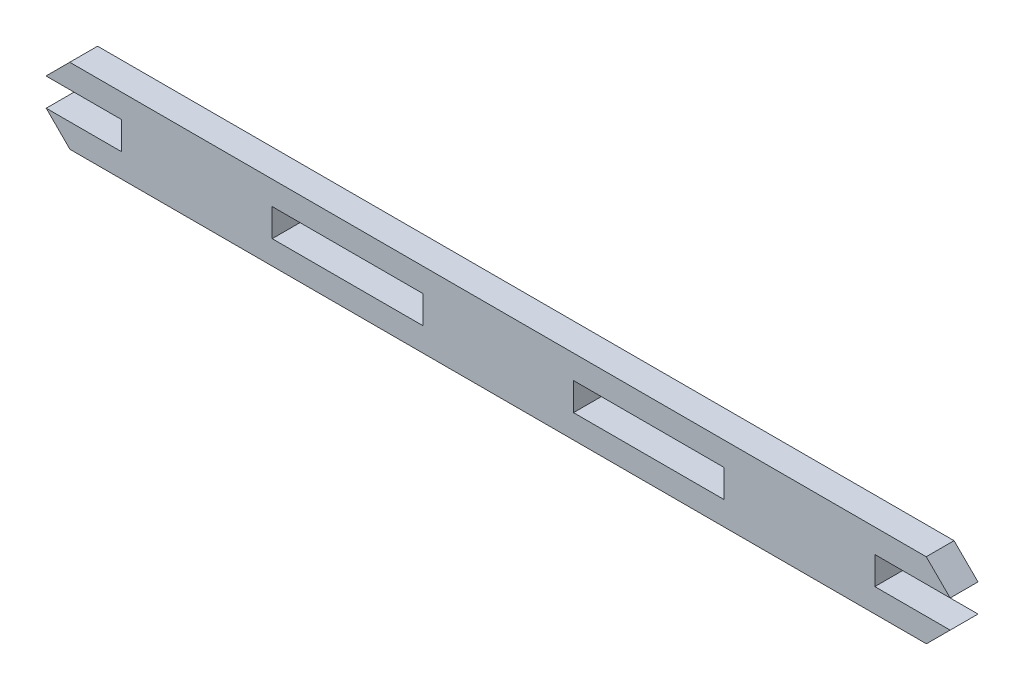
ISO-10303-21;
HEADER;
FILE_DESCRIPTION(('STEP AP214'),'2;1');
FILE_NAME('part.step','',(''),(''),'','','');
FILE_SCHEMA(('AUTOMOTIVE_DESIGN { 1 0 10303 214 1 1 1 1 }'));
ENDSEC;
DATA;
#1=APPLICATION_CONTEXT('core data for automotive mechanical design processes');
#2=APPLICATION_PROTOCOL_DEFINITION('international standard','automotive_design',2000,#1);
#3=PRODUCT_CONTEXT('',#1,'mechanical');
#4=PRODUCT('Part','Part','',(#3));
#5=PRODUCT_RELATED_PRODUCT_CATEGORY('part','',(#4));
#6=PRODUCT_DEFINITION_FORMATION('','',#4);
#7=PRODUCT_DEFINITION_CONTEXT('part definition',#1,'design');
#8=PRODUCT_DEFINITION('design','',#6,#7);
#9=PRODUCT_DEFINITION_SHAPE('','',#8);
#10=(LENGTH_UNIT() NAMED_UNIT(*) SI_UNIT(.MILLI.,.METRE.));
#11=(NAMED_UNIT(*) PLANE_ANGLE_UNIT() SI_UNIT($,.RADIAN.));
#12=(NAMED_UNIT(*) SI_UNIT($,.STERADIAN.) SOLID_ANGLE_UNIT());
#13=UNCERTAINTY_MEASURE_WITH_UNIT(LENGTH_MEASURE(1.E-05),#10,'distance_accuracy_value','');
#14=(GEOMETRIC_REPRESENTATION_CONTEXT(3) GLOBAL_UNCERTAINTY_ASSIGNED_CONTEXT((#13)) GLOBAL_UNIT_ASSIGNED_CONTEXT((#10,
#11,#12)) REPRESENTATION_CONTEXT('',''));
#15=CARTESIAN_POINT('',(0.,0.,0.));
#16=DIRECTION('',(0.,0.,1.));
#17=DIRECTION('',(1.,0.,0.));
#18=AXIS2_PLACEMENT_3D('',#15,#16,#17);
#19=CARTESIAN_POINT('',(0.,0.,5.54));
#20=DIRECTION('',(0.,0.,-1.));
#21=DIRECTION('',(-1.,0.,0.));
#22=AXIS2_PLACEMENT_3D('',#19,#20,#21);
#23=PLANE('',#22);
#24=DIRECTION('',(0.,-1.,0.));
#25=VECTOR('',#24,1.);
#26=CARTESIAN_POINT('',(155.922330422728,10.4160397605776,5.54));
#27=LINE('',#26,#25);
#28=CARTESIAN_POINT('',(155.922330422728,10.4160397605776,5.54));
#29=VERTEX_POINT('',#28);
#30=CARTESIAN_POINT('',(155.922330422728,4.8760397605776,5.54));
#31=VERTEX_POINT('',#30);
#32=EDGE_CURVE('E206',#29,#31,#27,.T.);
#33=ORIENTED_EDGE('',*,*,#32,.F.);
#34=DIRECTION('',(-1.,0.,0.));
#35=VECTOR('',#34,1.);
#36=CARTESIAN_POINT('',(155.922330422728,10.4160397605776,5.54));
#37=LINE('',#36,#35);
#38=CARTESIAN_POINT('',(185.922330422728,10.4160397605776,5.54));
#39=VERTEX_POINT('',#38);
#40=EDGE_CURVE('E214',#39,#29,#37,.T.);
#41=ORIENTED_EDGE('',*,*,#40,.F.);
#42=DIRECTION('',(0.,1.,0.));
#43=VECTOR('',#42,1.);
#44=CARTESIAN_POINT('',(185.922330422728,10.4160397605776,5.54));
#45=LINE('',#44,#43);
#46=CARTESIAN_POINT('',(185.922330422728,4.8760397605776,5.54));
#47=VERTEX_POINT('',#46);
#48=EDGE_CURVE('E211',#47,#39,#45,.T.);
#49=ORIENTED_EDGE('',*,*,#48,.F.);
#50=DIRECTION('',(1.,0.,0.));
#51=VECTOR('',#50,1.);
#52=CARTESIAN_POINT('',(155.922330422728,4.8760397605776,5.54));
#53=LINE('',#52,#51);
#54=EDGE_CURVE('E208',#31,#47,#53,.T.);
#55=ORIENTED_EDGE('',*,*,#54,.F.);
#56=EDGE_LOOP('',(#33,#41,#49,#55));
#57=FACE_BOUND('',#56,.T.);
#58=DIRECTION('',(-0.70710309183126,-0.707110470522586,0.));
#59=VECTOR('',#58,1.);
#60=CARTESIAN_POINT('',(50.8816655425328,10.4159904028131,5.54));
#61=LINE('',#60,#59);
#62=CARTESIAN_POINT('',(55.6116655422753,15.1460397605776,5.54));
#63=VERTEX_POINT('',#62);
#64=CARTESIAN_POINT('',(50.8816655425328,10.4159904028131,5.54));
#65=VERTEX_POINT('',#64);
#66=EDGE_CURVE('E237',#63,#65,#61,.T.);
#67=ORIENTED_EDGE('',*,*,#66,.T.);
#68=DIRECTION('',(1.,0.,0.));
#69=VECTOR('',#68,1.);
#70=CARTESIAN_POINT('',(50.8816655425328,10.4159904028131,5.54));
#71=LINE('',#70,#69);
#72=CARTESIAN_POINT('',(65.9223304227279,10.4159904028131,5.54));
#73=VERTEX_POINT('',#72);
#74=EDGE_CURVE('E240',#65,#73,#71,.T.);
#75=ORIENTED_EDGE('',*,*,#74,.T.);
#76=DIRECTION('',(0.,-1.,0.));
#77=VECTOR('',#76,1.);
#78=CARTESIAN_POINT('',(65.9223304227278,4.8760397605776,5.54));
#79=LINE('',#78,#77);
#80=CARTESIAN_POINT('',(65.9223304227278,4.8760397605776,5.54));
#81=VERTEX_POINT('',#80);
#82=EDGE_CURVE('E243',#73,#81,#79,.T.);
#83=ORIENTED_EDGE('',*,*,#82,.T.);
#84=DIRECTION('',(-1.,0.,0.));
#85=VECTOR('',#84,1.);
#86=CARTESIAN_POINT('',(50.9223304227278,4.8760397605776,5.54));
#87=LINE('',#86,#85);
#88=CARTESIAN_POINT('',(50.9223304227278,4.8760397605776,5.54));
#89=VERTEX_POINT('',#88);
#90=EDGE_CURVE('E245',#81,#89,#87,.T.);
#91=ORIENTED_EDGE('',*,*,#90,.T.);
#92=DIRECTION('',(0.706955946111809,-0.707257584093064,0.));
#93=VECTOR('',#92,1.);
#94=CARTESIAN_POINT('',(50.9223304227278,4.8760397605776,5.54));
#95=LINE('',#94,#93);
#96=CARTESIAN_POINT('',(55.6503131270728,0.146039760577601,5.54));
#97=VERTEX_POINT('',#96);
#98=EDGE_CURVE('E247',#89,#97,#95,.T.);
#99=ORIENTED_EDGE('',*,*,#98,.T.);
#100=DIRECTION('',(1.,0.,0.));
#101=VECTOR('',#100,1.);
#102=CARTESIAN_POINT('',(55.6503131270728,0.146039760577601,5.54));
#103=LINE('',#102,#101);
#104=CARTESIAN_POINT('',(226.190313127073,0.146039760577601,5.54));
#105=VERTEX_POINT('',#104);
#106=EDGE_CURVE('E249',#97,#105,#103,.T.);
#107=ORIENTED_EDGE('',*,*,#106,.T.);
#108=DIRECTION('',(0.707257519797774,0.706956010434526,0.));
#109=VECTOR('',#108,1.);
#110=CARTESIAN_POINT('',(226.190313127073,0.146039760577601,5.54));
#111=LINE('',#110,#109);
#112=CARTESIAN_POINT('',(230.922330422728,4.87603976057755,5.54));
#113=VERTEX_POINT('',#112);
#114=EDGE_CURVE('E251',#105,#113,#111,.T.);
#115=ORIENTED_EDGE('',*,*,#114,.T.);
#116=DIRECTION('',(-1.,0.,0.));
#117=VECTOR('',#116,1.);
#118=CARTESIAN_POINT('',(230.922330422728,4.87603976057755,5.54));
#119=LINE('',#118,#117);
#120=CARTESIAN_POINT('',(215.922330422728,4.87603976057755,5.54));
#121=VERTEX_POINT('',#120);
#122=EDGE_CURVE('E253',#113,#121,#119,.T.);
#123=ORIENTED_EDGE('',*,*,#122,.T.);
#124=DIRECTION('',(0.,1.,0.));
#125=VECTOR('',#124,1.);
#126=CARTESIAN_POINT('',(215.922330422728,4.87603976057755,5.54));
#127=LINE('',#126,#125);
#128=CARTESIAN_POINT('',(215.922330422728,10.4160397605776,5.54));
#129=VERTEX_POINT('',#128);
#130=EDGE_CURVE('E255',#121,#129,#127,.T.);
#131=ORIENTED_EDGE('',*,*,#130,.T.);
#132=DIRECTION('',(1.,0.,0.));
#133=VECTOR('',#132,1.);
#134=CARTESIAN_POINT('',(230.922330422728,10.4160397605776,5.54));
#135=LINE('',#134,#133);
#136=CARTESIAN_POINT('',(230.922330422728,10.4160397605776,5.54));
#137=VERTEX_POINT('',#136);
#138=EDGE_CURVE('E257',#129,#137,#135,.T.);
#139=ORIENTED_EDGE('',*,*,#138,.T.);
#140=DIRECTION('',(-0.71012684483663,0.704073763353224,0.));
#141=VECTOR('',#140,1.);
#142=CARTESIAN_POINT('',(226.151665542275,15.1460397605776,5.54));
#143=LINE('',#142,#141);
#144=CARTESIAN_POINT('',(226.151665542275,15.1460397605776,5.54));
#145=VERTEX_POINT('',#144);
#146=EDGE_CURVE('E259',#137,#145,#143,.T.);
#147=ORIENTED_EDGE('',*,*,#146,.T.);
#148=DIRECTION('',(-1.,0.,0.));
#149=VECTOR('',#148,1.);
#150=CARTESIAN_POINT('',(55.6116655422753,15.1460397605776,5.54));
#151=LINE('',#150,#149);
#152=EDGE_CURVE('E261',#145,#63,#151,.T.);
#153=ORIENTED_EDGE('',*,*,#152,.T.);
#154=EDGE_LOOP('',(#67,#75,#83,#91,#99,#107,#115,#123,#131,#139,#147,#153));
#155=FACE_BOUND('',#154,.T.);
#156=DIRECTION('',(-1.,0.,0.));
#157=VECTOR('',#156,1.);
#158=CARTESIAN_POINT('',(95.9223304227278,10.4160397605772,5.54));
#159=LINE('',#158,#157);
#160=CARTESIAN_POINT('',(125.922330422728,10.4160397605772,5.54));
#161=VERTEX_POINT('',#160);
#162=CARTESIAN_POINT('',(95.9223304227278,10.4160397605772,5.54));
#163=VERTEX_POINT('',#162);
#164=EDGE_CURVE('E170',#161,#163,#159,.T.);
#165=ORIENTED_EDGE('',*,*,#164,.F.);
#166=DIRECTION('',(0.,1.,0.));
#167=VECTOR('',#166,1.);
#168=CARTESIAN_POINT('',(125.922330422728,10.4160397605772,5.54));
#169=LINE('',#168,#167);
#170=CARTESIAN_POINT('',(125.922330422728,4.87603976057718,5.54));
#171=VERTEX_POINT('',#170);
#172=EDGE_CURVE('E192',#171,#161,#169,.T.);
#173=ORIENTED_EDGE('',*,*,#172,.F.);
#174=DIRECTION('',(1.,0.,0.));
#175=VECTOR('',#174,1.);
#176=CARTESIAN_POINT('',(95.9223304227277,4.87603976057718,5.54));
#177=LINE('',#176,#175);
#178=CARTESIAN_POINT('',(95.9223304227277,4.87603976057718,5.54));
#179=VERTEX_POINT('',#178);
#180=EDGE_CURVE('E190',#179,#171,#177,.T.);
#181=ORIENTED_EDGE('',*,*,#180,.F.);
#182=DIRECTION('',(0.,-1.,0.));
#183=VECTOR('',#182,1.);
#184=CARTESIAN_POINT('',(95.9223304227278,10.4160397605772,5.54));
#185=LINE('',#184,#183);
#186=EDGE_CURVE('E178',#163,#179,#185,.T.);
#187=ORIENTED_EDGE('',*,*,#186,.F.);
#188=EDGE_LOOP('',(#165,#173,#181,#187));
#189=FACE_BOUND('',#188,.T.);
#190=ADVANCED_FACE('F33',(#57,#155,#189),#23,.F.);
#191=CARTESIAN_POINT('',(0.,0.,0.));
#192=DIRECTION('',(0.,0.,-1.));
#193=DIRECTION('',(-1.,0.,0.));
#194=AXIS2_PLACEMENT_3D('',#191,#192,#193);
#195=PLANE('',#194);
#196=DIRECTION('',(-0.70710309183126,-0.707110470522586,0.));
#197=VECTOR('',#196,1.);
#198=CARTESIAN_POINT('',(50.8816655425328,10.4159904028131,0.));
#199=LINE('',#198,#197);
#200=CARTESIAN_POINT('',(55.6116655422753,15.1460397605776,0.));
#201=VERTEX_POINT('',#200);
#202=CARTESIAN_POINT('',(50.8816655425328,10.4159904028131,0.));
#203=VERTEX_POINT('',#202);
#204=EDGE_CURVE('E236',#201,#203,#199,.T.);
#205=ORIENTED_EDGE('',*,*,#204,.F.);
#206=DIRECTION('',(-1.,0.,0.));
#207=VECTOR('',#206,1.);
#208=CARTESIAN_POINT('',(55.6116655422753,15.1460397605776,0.));
#209=LINE('',#208,#207);
#210=CARTESIAN_POINT('',(226.151665542275,15.1460397605776,0.));
#211=VERTEX_POINT('',#210);
#212=EDGE_CURVE('E241',#211,#201,#209,.T.);
#213=ORIENTED_EDGE('',*,*,#212,.F.);
#214=DIRECTION('',(-0.71012684483663,0.704073763353224,0.));
#215=VECTOR('',#214,1.);
#216=CARTESIAN_POINT('',(226.151665542275,15.1460397605776,0.));
#217=LINE('',#216,#215);
#218=CARTESIAN_POINT('',(230.922330422728,10.4160397605776,0.));
#219=VERTEX_POINT('',#218);
#220=EDGE_CURVE('E284',#219,#211,#217,.T.);
#221=ORIENTED_EDGE('',*,*,#220,.F.);
#222=DIRECTION('',(1.,0.,0.));
#223=VECTOR('',#222,1.);
#224=CARTESIAN_POINT('',(230.922330422728,10.4160397605776,0.));
#225=LINE('',#224,#223);
#226=CARTESIAN_POINT('',(215.922330422728,10.4160397605776,0.));
#227=VERTEX_POINT('',#226);
#228=EDGE_CURVE('E282',#227,#219,#225,.T.);
#229=ORIENTED_EDGE('',*,*,#228,.F.);
#230=DIRECTION('',(0.,1.,0.));
#231=VECTOR('',#230,1.);
#232=CARTESIAN_POINT('',(215.922330422728,4.87603976057755,0.));
#233=LINE('',#232,#231);
#234=CARTESIAN_POINT('',(215.922330422728,4.87603976057755,0.));
#235=VERTEX_POINT('',#234);
#236=EDGE_CURVE('E280',#235,#227,#233,.T.);
#237=ORIENTED_EDGE('',*,*,#236,.F.);
#238=DIRECTION('',(-1.,0.,0.));
#239=VECTOR('',#238,1.);
#240=CARTESIAN_POINT('',(230.922330422728,4.87603976057755,0.));
#241=LINE('',#240,#239);
#242=CARTESIAN_POINT('',(230.922330422728,4.87603976057755,0.));
#243=VERTEX_POINT('',#242);
#244=EDGE_CURVE('E278',#243,#235,#241,.T.);
#245=ORIENTED_EDGE('',*,*,#244,.F.);
#246=DIRECTION('',(0.707257519797774,0.706956010434526,0.));
#247=VECTOR('',#246,1.);
#248=CARTESIAN_POINT('',(226.190313127073,0.146039760577601,0.));
#249=LINE('',#248,#247);
#250=CARTESIAN_POINT('',(226.190313127073,0.146039760577601,0.));
#251=VERTEX_POINT('',#250);
#252=EDGE_CURVE('E276',#251,#243,#249,.T.);
#253=ORIENTED_EDGE('',*,*,#252,.F.);
#254=DIRECTION('',(1.,0.,0.));
#255=VECTOR('',#254,1.);
#256=CARTESIAN_POINT('',(55.6503131270728,0.146039760577601,0.));
#257=LINE('',#256,#255);
#258=CARTESIAN_POINT('',(55.6503131270728,0.146039760577601,0.));
#259=VERTEX_POINT('',#258);
#260=EDGE_CURVE('E274',#259,#251,#257,.T.);
#261=ORIENTED_EDGE('',*,*,#260,.F.);
#262=DIRECTION('',(0.706955946111809,-0.707257584093064,0.));
#263=VECTOR('',#262,1.);
#264=CARTESIAN_POINT('',(50.9223304227278,4.8760397605776,0.));
#265=LINE('',#264,#263);
#266=CARTESIAN_POINT('',(50.9223304227278,4.8760397605776,0.));
#267=VERTEX_POINT('',#266);
#268=EDGE_CURVE('E272',#267,#259,#265,.T.);
#269=ORIENTED_EDGE('',*,*,#268,.F.);
#270=DIRECTION('',(-1.,0.,0.));
#271=VECTOR('',#270,1.);
#272=CARTESIAN_POINT('',(50.9223304227278,4.8760397605776,0.));
#273=LINE('',#272,#271);
#274=CARTESIAN_POINT('',(65.9223304227278,4.8760397605776,0.));
#275=VERTEX_POINT('',#274);
#276=EDGE_CURVE('E270',#275,#267,#273,.T.);
#277=ORIENTED_EDGE('',*,*,#276,.F.);
#278=DIRECTION('',(0.,-1.,0.));
#279=VECTOR('',#278,1.);
#280=CARTESIAN_POINT('',(65.9223304227278,4.8760397605776,0.));
#281=LINE('',#280,#279);
#282=CARTESIAN_POINT('',(65.9223304227279,10.4159904028131,0.));
#283=VERTEX_POINT('',#282);
#284=EDGE_CURVE('E268',#283,#275,#281,.T.);
#285=ORIENTED_EDGE('',*,*,#284,.F.);
#286=DIRECTION('',(1.,0.,0.));
#287=VECTOR('',#286,1.);
#288=CARTESIAN_POINT('',(50.8816655425328,10.4159904028131,0.));
#289=LINE('',#288,#287);
#290=EDGE_CURVE('E266',#203,#283,#289,.T.);
#291=ORIENTED_EDGE('',*,*,#290,.F.);
#292=EDGE_LOOP('',(#205,#213,#221,#229,#237,#245,#253,#261,#269,#277,#285,#291));
#293=FACE_BOUND('',#292,.T.);
#294=DIRECTION('',(-1.,0.,0.));
#295=VECTOR('',#294,1.);
#296=CARTESIAN_POINT('',(155.922330422728,10.4160397605776,0.));
#297=LINE('',#296,#295);
#298=CARTESIAN_POINT('',(185.922330422728,10.4160397605776,0.));
#299=VERTEX_POINT('',#298);
#300=CARTESIAN_POINT('',(155.922330422728,10.4160397605776,0.));
#301=VERTEX_POINT('',#300);
#302=EDGE_CURVE('E209',#299,#301,#297,.T.);
#303=ORIENTED_EDGE('',*,*,#302,.T.);
#304=DIRECTION('',(0.,-1.,0.));
#305=VECTOR('',#304,1.);
#306=CARTESIAN_POINT('',(155.922330422728,10.4160397605776,0.));
#307=LINE('',#306,#305);
#308=CARTESIAN_POINT('',(155.922330422728,4.8760397605776,0.));
#309=VERTEX_POINT('',#308);
#310=EDGE_CURVE('E186',#301,#309,#307,.T.);
#311=ORIENTED_EDGE('',*,*,#310,.T.);
#312=DIRECTION('',(1.,0.,0.));
#313=VECTOR('',#312,1.);
#314=CARTESIAN_POINT('',(155.922330422728,4.8760397605776,0.));
#315=LINE('',#314,#313);
#316=CARTESIAN_POINT('',(185.922330422728,4.8760397605776,0.));
#317=VERTEX_POINT('',#316);
#318=EDGE_CURVE('E219',#309,#317,#315,.T.);
#319=ORIENTED_EDGE('',*,*,#318,.T.);
#320=DIRECTION('',(0.,1.,0.));
#321=VECTOR('',#320,1.);
#322=CARTESIAN_POINT('',(185.922330422728,10.4160397605776,0.));
#323=LINE('',#322,#321);
#324=EDGE_CURVE('E222',#317,#299,#323,.T.);
#325=ORIENTED_EDGE('',*,*,#324,.T.);
#326=EDGE_LOOP('',(#303,#311,#319,#325));
#327=FACE_BOUND('',#326,.T.);
#328=DIRECTION('',(0.,1.,0.));
#329=VECTOR('',#328,1.);
#330=CARTESIAN_POINT('',(125.922330422728,10.4160397605772,0.));
#331=LINE('',#330,#329);
#332=CARTESIAN_POINT('',(125.922330422728,4.87603976057718,0.));
#333=VERTEX_POINT('',#332);
#334=CARTESIAN_POINT('',(125.922330422728,10.4160397605772,0.));
#335=VERTEX_POINT('',#334);
#336=EDGE_CURVE('E179',#333,#335,#331,.T.);
#337=ORIENTED_EDGE('',*,*,#336,.T.);
#338=DIRECTION('',(-1.,0.,0.));
#339=VECTOR('',#338,1.);
#340=CARTESIAN_POINT('',(95.9223304227278,10.4160397605772,0.));
#341=LINE('',#340,#339);
#342=CARTESIAN_POINT('',(95.9223304227278,10.4160397605772,0.));
#343=VERTEX_POINT('',#342);
#344=EDGE_CURVE('E56',#335,#343,#341,.T.);
#345=ORIENTED_EDGE('',*,*,#344,.T.);
#346=DIRECTION('',(0.,-1.,0.));
#347=VECTOR('',#346,1.);
#348=CARTESIAN_POINT('',(95.9223304227278,10.4160397605772,0.));
#349=LINE('',#348,#347);
#350=CARTESIAN_POINT('',(95.9223304227277,4.87603976057718,0.));
#351=VERTEX_POINT('',#350);
#352=EDGE_CURVE('E185',#343,#351,#349,.T.);
#353=ORIENTED_EDGE('',*,*,#352,.T.);
#354=DIRECTION('',(1.,0.,0.));
#355=VECTOR('',#354,1.);
#356=CARTESIAN_POINT('',(95.9223304227277,4.87603976057718,0.));
#357=LINE('',#356,#355);
#358=EDGE_CURVE('E198',#351,#333,#357,.T.);
#359=ORIENTED_EDGE('',*,*,#358,.T.);
#360=EDGE_LOOP('',(#337,#345,#353,#359));
#361=FACE_BOUND('',#360,.T.);
#362=ADVANCED_FACE('F326',(#293,#327,#361),#195,.T.);
#363=CARTESIAN_POINT('',(50.8816655425328,10.4159904028131,5.54));
#364=DIRECTION('',(0.707110470522586,-0.70710309183126,0.));
#365=DIRECTION('',(0.70710309183126,0.707110470522586,0.));
#366=AXIS2_PLACEMENT_3D('',#363,#364,#365);
#367=PLANE('',#366);
#368=ORIENTED_EDGE('',*,*,#204,.T.);
#369=DIRECTION('',(0.,0.,-1.));
#370=VECTOR('',#369,1.);
#371=CARTESIAN_POINT('',(50.8816655425328,10.4159904028131,5.54));
#372=LINE('',#371,#370);
#373=EDGE_CURVE('E11',#65,#203,#372,.T.);
#374=ORIENTED_EDGE('',*,*,#373,.F.);
#375=ORIENTED_EDGE('',*,*,#66,.F.);
#376=DIRECTION('',(0.,0.,-1.));
#377=VECTOR('',#376,1.);
#378=CARTESIAN_POINT('',(55.6116655422753,15.1460397605776,5.54));
#379=LINE('',#378,#377);
#380=EDGE_CURVE('E263',#63,#201,#379,.T.);
#381=ORIENTED_EDGE('',*,*,#380,.T.);
#382=EDGE_LOOP('',(#368,#374,#375,#381));
#383=FACE_BOUND('',#382,.T.);
#384=ADVANCED_FACE('F35',(#383),#367,.F.);
#385=CARTESIAN_POINT('',(50.8816655425328,10.4159904028131,5.54));
#386=DIRECTION('',(0.,1.,0.));
#387=DIRECTION('',(0.,0.,1.));
#388=AXIS2_PLACEMENT_3D('',#385,#386,#387);
#389=PLANE('',#388);
#390=ORIENTED_EDGE('',*,*,#290,.T.);
#391=DIRECTION('',(0.,0.,-1.));
#392=VECTOR('',#391,1.);
#393=CARTESIAN_POINT('',(65.9223304227279,10.4159904028131,5.54));
#394=LINE('',#393,#392);
#395=EDGE_CURVE('E41',#73,#283,#394,.T.);
#396=ORIENTED_EDGE('',*,*,#395,.F.);
#397=ORIENTED_EDGE('',*,*,#74,.F.);
#398=ORIENTED_EDGE('',*,*,#373,.T.);
#399=EDGE_LOOP('',(#390,#396,#397,#398));
#400=FACE_BOUND('',#399,.T.);
#401=ADVANCED_FACE('F343',(#400),#389,.F.);
#402=CARTESIAN_POINT('',(65.9223304227278,4.8760397605776,5.54));
#403=DIRECTION('',(1.,0.,0.));
#404=DIRECTION('',(0.,1.,0.));
#405=AXIS2_PLACEMENT_3D('',#402,#403,#404);
#406=PLANE('',#405);
#407=ORIENTED_EDGE('',*,*,#284,.T.);
#408=DIRECTION('',(0.,0.,-1.));
#409=VECTOR('',#408,1.);
#410=CARTESIAN_POINT('',(65.9223304227278,4.8760397605776,5.54));
#411=LINE('',#410,#409);
#412=EDGE_CURVE('E313',#81,#275,#411,.T.);
#413=ORIENTED_EDGE('',*,*,#412,.F.);
#414=ORIENTED_EDGE('',*,*,#82,.F.);
#415=ORIENTED_EDGE('',*,*,#395,.T.);
#416=EDGE_LOOP('',(#407,#413,#414,#415));
#417=FACE_BOUND('',#416,.T.);
#418=ADVANCED_FACE('F320',(#417),#406,.F.);
#419=CARTESIAN_POINT('',(50.9223304227278,4.8760397605776,5.54));
#420=DIRECTION('',(0.,-1.,0.));
#421=DIRECTION('',(0.,0.,-1.));
#422=AXIS2_PLACEMENT_3D('',#419,#420,#421);
#423=PLANE('',#422);
#424=ORIENTED_EDGE('',*,*,#276,.T.);
#425=DIRECTION('',(0.,0.,-1.));
#426=VECTOR('',#425,1.);
#427=CARTESIAN_POINT('',(50.9223304227278,4.8760397605776,5.54));
#428=LINE('',#427,#426);
#429=EDGE_CURVE('E310',#89,#267,#428,.T.);
#430=ORIENTED_EDGE('',*,*,#429,.F.);
#431=ORIENTED_EDGE('',*,*,#90,.F.);
#432=ORIENTED_EDGE('',*,*,#412,.T.);
#433=EDGE_LOOP('',(#424,#430,#431,#432));
#434=FACE_BOUND('',#433,.T.);
#435=ADVANCED_FACE('F332',(#434),#423,.F.);
#436=CARTESIAN_POINT('',(50.9223304227278,4.8760397605776,5.54));
#437=DIRECTION('',(0.707257584093064,0.706955946111809,0.));
#438=DIRECTION('',(-0.706955946111809,0.707257584093064,0.));
#439=AXIS2_PLACEMENT_3D('',#436,#437,#438);
#440=PLANE('',#439);
#441=ORIENTED_EDGE('',*,*,#268,.T.);
#442=DIRECTION('',(0.,0.,-1.));
#443=VECTOR('',#442,1.);
#444=CARTESIAN_POINT('',(55.6503131270728,0.146039760577601,5.54));
#445=LINE('',#444,#443);
#446=EDGE_CURVE('E307',#97,#259,#445,.T.);
#447=ORIENTED_EDGE('',*,*,#446,.F.);
#448=ORIENTED_EDGE('',*,*,#98,.F.);
#449=ORIENTED_EDGE('',*,*,#429,.T.);
#450=EDGE_LOOP('',(#441,#447,#448,#449));
#451=FACE_BOUND('',#450,.T.);
#452=ADVANCED_FACE('F336',(#451),#440,.F.);
#453=CARTESIAN_POINT('',(55.6503131270728,0.146039760577601,5.54));
#454=DIRECTION('',(0.,1.,0.));
#455=DIRECTION('',(0.,0.,1.));
#456=AXIS2_PLACEMENT_3D('',#453,#454,#455);
#457=PLANE('',#456);
#458=ORIENTED_EDGE('',*,*,#260,.T.);
#459=DIRECTION('',(0.,0.,-1.));
#460=VECTOR('',#459,1.);
#461=CARTESIAN_POINT('',(226.190313127073,0.146039760577601,5.54));
#462=LINE('',#461,#460);
#463=EDGE_CURVE('E304',#105,#251,#462,.T.);
#464=ORIENTED_EDGE('',*,*,#463,.F.);
#465=ORIENTED_EDGE('',*,*,#106,.F.);
#466=ORIENTED_EDGE('',*,*,#446,.T.);
#467=EDGE_LOOP('',(#458,#464,#465,#466));
#468=FACE_BOUND('',#467,.T.);
#469=ADVANCED_FACE('F376',(#468),#457,.F.);
#470=CARTESIAN_POINT('',(226.190313127073,0.146039760577601,5.54));
#471=DIRECTION('',(-0.706956010434526,0.707257519797774,0.));
#472=DIRECTION('',(-0.707257519797774,-0.706956010434526,0.));
#473=AXIS2_PLACEMENT_3D('',#470,#471,#472);
#474=PLANE('',#473);
#475=ORIENTED_EDGE('',*,*,#252,.T.);
#476=DIRECTION('',(0.,0.,-1.));
#477=VECTOR('',#476,1.);
#478=CARTESIAN_POINT('',(230.922330422728,4.87603976057755,5.54));
#479=LINE('',#478,#477);
#480=EDGE_CURVE('E301',#113,#243,#479,.T.);
#481=ORIENTED_EDGE('',*,*,#480,.F.);
#482=ORIENTED_EDGE('',*,*,#114,.F.);
#483=ORIENTED_EDGE('',*,*,#463,.T.);
#484=EDGE_LOOP('',(#475,#481,#482,#483));
#485=FACE_BOUND('',#484,.T.);
#486=ADVANCED_FACE('F374',(#485),#474,.F.);
#487=CARTESIAN_POINT('',(230.922330422728,4.87603976057755,5.54));
#488=DIRECTION('',(0.,-1.,0.));
#489=DIRECTION('',(1.,0.,0.));
#490=AXIS2_PLACEMENT_3D('',#487,#488,#489);
#491=PLANE('',#490);
#492=ORIENTED_EDGE('',*,*,#244,.T.);
#493=DIRECTION('',(0.,0.,-1.));
#494=VECTOR('',#493,1.);
#495=CARTESIAN_POINT('',(215.922330422728,4.87603976057755,5.54));
#496=LINE('',#495,#494);
#497=EDGE_CURVE('E298',#121,#235,#496,.T.);
#498=ORIENTED_EDGE('',*,*,#497,.F.);
#499=ORIENTED_EDGE('',*,*,#122,.F.);
#500=ORIENTED_EDGE('',*,*,#480,.T.);
#501=EDGE_LOOP('',(#492,#498,#499,#500));
#502=FACE_BOUND('',#501,.T.);
#503=ADVANCED_FACE('F370',(#502),#491,.F.);
#504=CARTESIAN_POINT('',(215.922330422728,4.87603976057755,5.54));
#505=DIRECTION('',(-1.,0.,0.));
#506=DIRECTION('',(0.,0.,1.));
#507=AXIS2_PLACEMENT_3D('',#504,#505,#506);
#508=PLANE('',#507);
#509=ORIENTED_EDGE('',*,*,#236,.T.);
#510=DIRECTION('',(0.,0.,-1.));
#511=VECTOR('',#510,1.);
#512=CARTESIAN_POINT('',(215.922330422728,10.4160397605776,5.54));
#513=LINE('',#512,#511);
#514=EDGE_CURVE('E295',#129,#227,#513,.T.);
#515=ORIENTED_EDGE('',*,*,#514,.F.);
#516=ORIENTED_EDGE('',*,*,#130,.F.);
#517=ORIENTED_EDGE('',*,*,#497,.T.);
#518=EDGE_LOOP('',(#509,#515,#516,#517));
#519=FACE_BOUND('',#518,.T.);
#520=ADVANCED_FACE('F365',(#519),#508,.F.);
#521=CARTESIAN_POINT('',(230.922330422728,10.4160397605776,5.54));
#522=DIRECTION('',(0.,1.,0.));
#523=DIRECTION('',(-1.,0.,0.));
#524=AXIS2_PLACEMENT_3D('',#521,#522,#523);
#525=PLANE('',#524);
#526=ORIENTED_EDGE('',*,*,#228,.T.);
#527=DIRECTION('',(0.,0.,-1.));
#528=VECTOR('',#527,1.);
#529=CARTESIAN_POINT('',(230.922330422728,10.4160397605776,5.54));
#530=LINE('',#529,#528);
#531=EDGE_CURVE('E292',#137,#219,#530,.T.);
#532=ORIENTED_EDGE('',*,*,#531,.F.);
#533=ORIENTED_EDGE('',*,*,#138,.F.);
#534=ORIENTED_EDGE('',*,*,#514,.T.);
#535=EDGE_LOOP('',(#526,#532,#533,#534));
#536=FACE_BOUND('',#535,.T.);
#537=ADVANCED_FACE('F359',(#536),#525,.F.);
#538=CARTESIAN_POINT('',(226.151665542275,15.1460397605776,5.54));
#539=DIRECTION('',(-0.704073763353224,-0.71012684483663,0.));
#540=DIRECTION('',(0.71012684483663,-0.704073763353224,0.));
#541=AXIS2_PLACEMENT_3D('',#538,#539,#540);
#542=PLANE('',#541);
#543=ORIENTED_EDGE('',*,*,#220,.T.);
#544=DIRECTION('',(0.,0.,-1.));
#545=VECTOR('',#544,1.);
#546=CARTESIAN_POINT('',(226.151665542275,15.1460397605776,5.54));
#547=LINE('',#546,#545);
#548=EDGE_CURVE('E289',#145,#211,#547,.T.);
#549=ORIENTED_EDGE('',*,*,#548,.F.);
#550=ORIENTED_EDGE('',*,*,#146,.F.);
#551=ORIENTED_EDGE('',*,*,#531,.T.);
#552=EDGE_LOOP('',(#543,#549,#550,#551));
#553=FACE_BOUND('',#552,.T.);
#554=ADVANCED_FACE('F355',(#553),#542,.F.);
#555=CARTESIAN_POINT('',(55.6116655422753,15.1460397605776,5.54));
#556=DIRECTION('',(0.,-1.,0.));
#557=DIRECTION('',(1.,0.,0.));
#558=AXIS2_PLACEMENT_3D('',#555,#556,#557);
#559=PLANE('',#558);
#560=ORIENTED_EDGE('',*,*,#212,.T.);
#561=ORIENTED_EDGE('',*,*,#380,.F.);
#562=ORIENTED_EDGE('',*,*,#152,.F.);
#563=ORIENTED_EDGE('',*,*,#548,.T.);
#564=EDGE_LOOP('',(#560,#561,#562,#563));
#565=FACE_BOUND('',#564,.T.);
#566=ADVANCED_FACE('F350',(#565),#559,.F.);
#567=CARTESIAN_POINT('',(155.922330422728,10.4160397605776,5.54));
#568=DIRECTION('',(1.,0.,0.));
#569=DIRECTION('',(0.,1.,0.));
#570=AXIS2_PLACEMENT_3D('',#567,#568,#569);
#571=PLANE('',#570);
#572=ORIENTED_EDGE('',*,*,#310,.F.);
#573=DIRECTION('',(0.,0.,-1.));
#574=VECTOR('',#573,1.);
#575=CARTESIAN_POINT('',(155.922330422728,10.4160397605776,5.54));
#576=LINE('',#575,#574);
#577=EDGE_CURVE('E216',#29,#301,#576,.T.);
#578=ORIENTED_EDGE('',*,*,#577,.F.);
#579=ORIENTED_EDGE('',*,*,#32,.T.);
#580=DIRECTION('',(0.,0.,-1.));
#581=VECTOR('',#580,1.);
#582=CARTESIAN_POINT('',(155.922330422728,4.8760397605776,5.54));
#583=LINE('',#582,#581);
#584=EDGE_CURVE('E233',#31,#309,#583,.T.);
#585=ORIENTED_EDGE('',*,*,#584,.T.);
#586=EDGE_LOOP('',(#572,#578,#579,#585));
#587=FACE_BOUND('',#586,.T.);
#588=ADVANCED_FACE('F394',(#587),#571,.T.);
#589=CARTESIAN_POINT('',(155.922330422728,4.8760397605776,5.54));
#590=DIRECTION('',(0.,1.,0.));
#591=DIRECTION('',(0.,0.,1.));
#592=AXIS2_PLACEMENT_3D('',#589,#590,#591);
#593=PLANE('',#592);
#594=ORIENTED_EDGE('',*,*,#318,.F.);
#595=ORIENTED_EDGE('',*,*,#584,.F.);
#596=ORIENTED_EDGE('',*,*,#54,.T.);
#597=DIRECTION('',(0.,0.,-1.));
#598=VECTOR('',#597,1.);
#599=CARTESIAN_POINT('',(185.922330422728,4.8760397605776,5.54));
#600=LINE('',#599,#598);
#601=EDGE_CURVE('E231',#47,#317,#600,.T.);
#602=ORIENTED_EDGE('',*,*,#601,.T.);
#603=EDGE_LOOP('',(#594,#595,#596,#602));
#604=FACE_BOUND('',#603,.T.);
#605=ADVANCED_FACE('F432',(#604),#593,.T.);
#606=CARTESIAN_POINT('',(185.922330422728,10.4160397605776,5.54));
#607=DIRECTION('',(-1.,0.,0.));
#608=DIRECTION('',(0.,0.,1.));
#609=AXIS2_PLACEMENT_3D('',#606,#607,#608);
#610=PLANE('',#609);
#611=ORIENTED_EDGE('',*,*,#324,.F.);
#612=ORIENTED_EDGE('',*,*,#601,.F.);
#613=ORIENTED_EDGE('',*,*,#48,.T.);
#614=DIRECTION('',(0.,0.,-1.));
#615=VECTOR('',#614,1.);
#616=CARTESIAN_POINT('',(185.922330422728,10.4160397605776,5.54));
#617=LINE('',#616,#615);
#618=EDGE_CURVE('E229',#39,#299,#617,.T.);
#619=ORIENTED_EDGE('',*,*,#618,.T.);
#620=EDGE_LOOP('',(#611,#612,#613,#619));
#621=FACE_BOUND('',#620,.T.);
#622=ADVANCED_FACE('F439',(#621),#610,.T.);
#623=CARTESIAN_POINT('',(155.922330422728,10.4160397605776,5.54));
#624=DIRECTION('',(0.,-1.,0.));
#625=DIRECTION('',(0.,0.,-1.));
#626=AXIS2_PLACEMENT_3D('',#623,#624,#625);
#627=PLANE('',#626);
#628=ORIENTED_EDGE('',*,*,#302,.F.);
#629=ORIENTED_EDGE('',*,*,#618,.F.);
#630=ORIENTED_EDGE('',*,*,#40,.T.);
#631=ORIENTED_EDGE('',*,*,#577,.T.);
#632=EDGE_LOOP('',(#628,#629,#630,#631));
#633=FACE_BOUND('',#632,.T.);
#634=ADVANCED_FACE('F446',(#633),#627,.T.);
#635=CARTESIAN_POINT('',(95.9223304227278,10.4160397605772,5.54));
#636=DIRECTION('',(0.,-1.,0.));
#637=DIRECTION('',(0.,0.,-1.));
#638=AXIS2_PLACEMENT_3D('',#635,#636,#637);
#639=PLANE('',#638);
#640=ORIENTED_EDGE('',*,*,#344,.F.);
#641=DIRECTION('',(0.,0.,-1.));
#642=VECTOR('',#641,1.);
#643=CARTESIAN_POINT('',(125.922330422728,10.4160397605772,5.54));
#644=LINE('',#643,#642);
#645=EDGE_CURVE('E174',#161,#335,#644,.T.);
#646=ORIENTED_EDGE('',*,*,#645,.F.);
#647=ORIENTED_EDGE('',*,*,#164,.T.);
#648=DIRECTION('',(0.,0.,-1.));
#649=VECTOR('',#648,1.);
#650=CARTESIAN_POINT('',(95.9223304227278,10.4160397605772,5.54));
#651=LINE('',#650,#649);
#652=EDGE_CURVE('E173',#163,#343,#651,.T.);
#653=ORIENTED_EDGE('',*,*,#652,.T.);
#654=EDGE_LOOP('',(#640,#646,#647,#653));
#655=FACE_BOUND('',#654,.T.);
#656=ADVANCED_FACE('F172',(#655),#639,.T.);
#657=CARTESIAN_POINT('',(95.9223304227278,10.4160397605772,5.54));
#658=DIRECTION('',(1.,0.,0.));
#659=DIRECTION('',(0.,1.,0.));
#660=AXIS2_PLACEMENT_3D('',#657,#658,#659);
#661=PLANE('',#660);
#662=ORIENTED_EDGE('',*,*,#352,.F.);
#663=ORIENTED_EDGE('',*,*,#652,.F.);
#664=ORIENTED_EDGE('',*,*,#186,.T.);
#665=DIRECTION('',(0.,0.,-1.));
#666=VECTOR('',#665,1.);
#667=CARTESIAN_POINT('',(95.9223304227277,4.87603976057718,5.54));
#668=LINE('',#667,#666);
#669=EDGE_CURVE('E187',#179,#351,#668,.T.);
#670=ORIENTED_EDGE('',*,*,#669,.T.);
#671=EDGE_LOOP('',(#662,#663,#664,#670));
#672=FACE_BOUND('',#671,.T.);
#673=ADVANCED_FACE('F182',(#672),#661,.T.);
#674=CARTESIAN_POINT('',(95.9223304227277,4.87603976057718,5.54));
#675=DIRECTION('',(0.,1.,0.));
#676=DIRECTION('',(0.,0.,1.));
#677=AXIS2_PLACEMENT_3D('',#674,#675,#676);
#678=PLANE('',#677);
#679=ORIENTED_EDGE('',*,*,#358,.F.);
#680=ORIENTED_EDGE('',*,*,#669,.F.);
#681=ORIENTED_EDGE('',*,*,#180,.T.);
#682=DIRECTION('',(0.,0.,-1.));
#683=VECTOR('',#682,1.);
#684=CARTESIAN_POINT('',(125.922330422728,4.87603976057718,5.54));
#685=LINE('',#684,#683);
#686=EDGE_CURVE('E48',#171,#333,#685,.T.);
#687=ORIENTED_EDGE('',*,*,#686,.T.);
#688=EDGE_LOOP('',(#679,#680,#681,#687));
#689=FACE_BOUND('',#688,.T.);
#690=ADVANCED_FACE('F467',(#689),#678,.T.);
#691=CARTESIAN_POINT('',(125.922330422728,10.4160397605772,5.54));
#692=DIRECTION('',(-1.,0.,0.));
#693=DIRECTION('',(0.,0.,1.));
#694=AXIS2_PLACEMENT_3D('',#691,#692,#693);
#695=PLANE('',#694);
#696=ORIENTED_EDGE('',*,*,#336,.F.);
#697=ORIENTED_EDGE('',*,*,#686,.F.);
#698=ORIENTED_EDGE('',*,*,#172,.T.);
#699=ORIENTED_EDGE('',*,*,#645,.T.);
#700=EDGE_LOOP('',(#696,#697,#698,#699));
#701=FACE_BOUND('',#700,.T.);
#702=ADVANCED_FACE('F474',(#701),#695,.T.);
#703=CLOSED_SHELL('',(#190,#362,#384,#401,#418,#435,#452,#469,#486,#503,#520,#537,#554,#566,
#588,#605,#622,#634,#656,#673,#690,#702));
#704=MANIFOLD_SOLID_BREP('B2',#703);
#705=ADVANCED_BREP_SHAPE_REPRESENTATION('',(#18,#704),#14);
#706=SHAPE_DEFINITION_REPRESENTATION(#9,#705);
ENDSEC;
END-ISO-10303-21;
